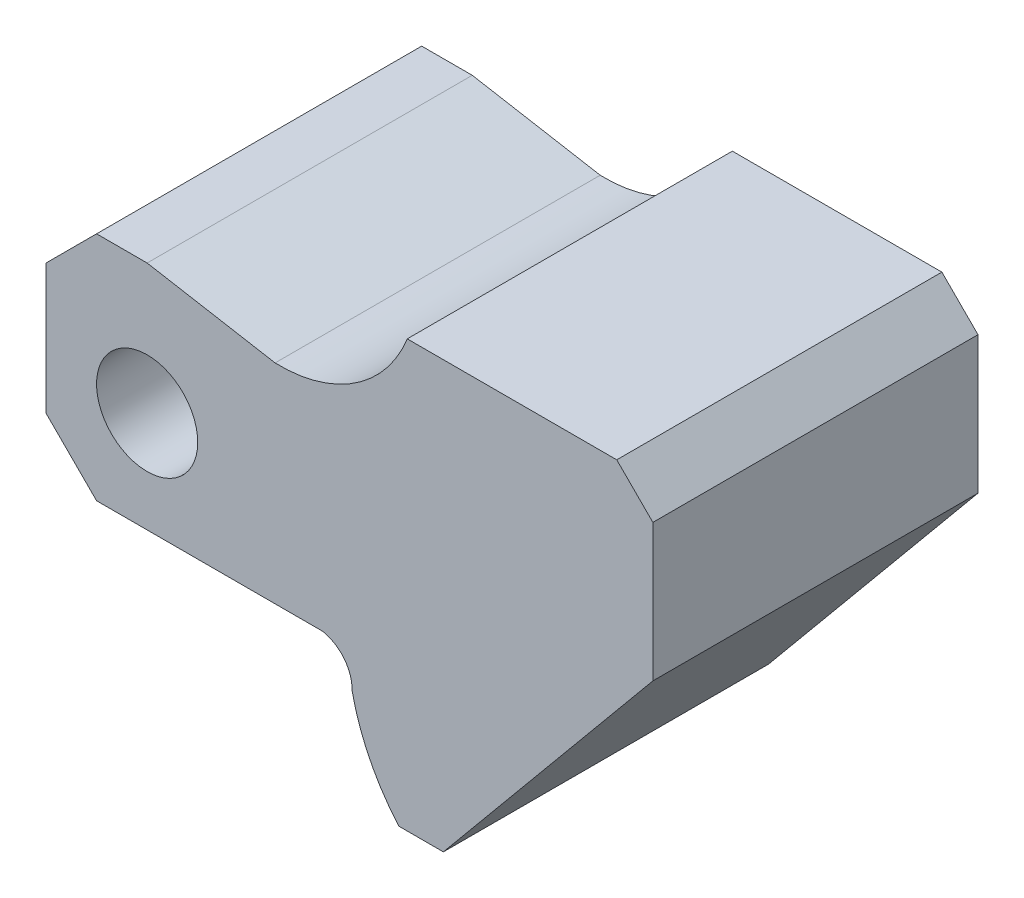
ISO-10303-21;
HEADER;
FILE_DESCRIPTION(('STEP AP214'),'2;1');
FILE_NAME('part.step','',(''),(''),'','','');
FILE_SCHEMA(('AUTOMOTIVE_DESIGN { 1 0 10303 214 1 1 1 1 }'));
ENDSEC;
DATA;
#1=APPLICATION_CONTEXT('core data for automotive mechanical design processes');
#2=APPLICATION_PROTOCOL_DEFINITION('international standard','automotive_design',2000,#1);
#3=PRODUCT_CONTEXT('',#1,'mechanical');
#4=PRODUCT('Part','Part','',(#3));
#5=PRODUCT_RELATED_PRODUCT_CATEGORY('part','',(#4));
#6=PRODUCT_DEFINITION_FORMATION('','',#4);
#7=PRODUCT_DEFINITION_CONTEXT('part definition',#1,'design');
#8=PRODUCT_DEFINITION('design','',#6,#7);
#9=PRODUCT_DEFINITION_SHAPE('','',#8);
#10=(LENGTH_UNIT() NAMED_UNIT(*) SI_UNIT(.MILLI.,.METRE.));
#11=(NAMED_UNIT(*) PLANE_ANGLE_UNIT() SI_UNIT($,.RADIAN.));
#12=(NAMED_UNIT(*) SI_UNIT($,.STERADIAN.) SOLID_ANGLE_UNIT());
#13=UNCERTAINTY_MEASURE_WITH_UNIT(LENGTH_MEASURE(1.E-05),#10,'distance_accuracy_value','');
#14=(GEOMETRIC_REPRESENTATION_CONTEXT(3) GLOBAL_UNCERTAINTY_ASSIGNED_CONTEXT((#13)) GLOBAL_UNIT_ASSIGNED_CONTEXT((#10,
#11,#12)) REPRESENTATION_CONTEXT('',''));
#15=CARTESIAN_POINT('',(0.,0.,0.));
#16=DIRECTION('',(0.,0.,1.));
#17=DIRECTION('',(1.,0.,0.));
#18=AXIS2_PLACEMENT_3D('',#15,#16,#17);
#19=CARTESIAN_POINT('',(17.0554988623098,8.67643427055628,45.));
#20=DIRECTION('',(0.707106781186536,0.707106781186559,0.));
#21=DIRECTION('',(-0.707106781186559,0.707106781186536,0.));
#22=AXIS2_PLACEMENT_3D('',#19,#20,#21);
#23=PLANE('',#22);
#24=DIRECTION('',(0.707106781186559,-0.707106781186536,0.));
#25=VECTOR('',#24,1.);
#26=CARTESIAN_POINT('',(17.0554988623098,8.67643427055628,0.));
#27=LINE('',#26,#25);
#28=CARTESIAN_POINT('',(17.0554988623098,8.67643427055628,0.));
#29=VERTEX_POINT('',#28);
#30=CARTESIAN_POINT('',(24.05549886231,1.67643427055628,0.));
#31=VERTEX_POINT('',#30);
#32=EDGE_CURVE('E169',#29,#31,#27,.T.);
#33=ORIENTED_EDGE('',*,*,#32,.T.);
#34=DIRECTION('',(0.,0.,-1.));
#35=VECTOR('',#34,1.);
#36=CARTESIAN_POINT('',(24.05549886231,1.67643427055628,45.));
#37=LINE('',#36,#35);
#38=CARTESIAN_POINT('',(24.05549886231,1.67643427055628,45.));
#39=VERTEX_POINT('',#38);
#40=EDGE_CURVE('E11',#39,#31,#37,.T.);
#41=ORIENTED_EDGE('',*,*,#40,.F.);
#42=DIRECTION('',(0.707106781186559,-0.707106781186536,0.));
#43=VECTOR('',#42,1.);
#44=CARTESIAN_POINT('',(17.0554988623098,8.67643427055628,45.));
#45=LINE('',#44,#43);
#46=CARTESIAN_POINT('',(17.0554988623098,8.67643427055628,45.));
#47=VERTEX_POINT('',#46);
#48=EDGE_CURVE('E196',#47,#39,#45,.T.);
#49=ORIENTED_EDGE('',*,*,#48,.F.);
#50=DIRECTION('',(0.,0.,-1.));
#51=VECTOR('',#50,1.);
#52=CARTESIAN_POINT('',(17.0554988623098,8.67643427055628,45.));
#53=LINE('',#52,#51);
#54=EDGE_CURVE('E165',#47,#29,#53,.T.);
#55=ORIENTED_EDGE('',*,*,#54,.T.);
#56=EDGE_LOOP('',(#33,#41,#49,#55));
#57=FACE_BOUND('',#56,.T.);
#58=ADVANCED_FACE('F37',(#57),#23,.F.);
#59=CARTESIAN_POINT('',(24.05549886231,1.67643427055628,45.));
#60=DIRECTION('',(0.,1.,0.));
#61=DIRECTION('',(0.,0.,1.));
#62=AXIS2_PLACEMENT_3D('',#59,#60,#61);
#63=PLANE('',#62);
#64=DIRECTION('',(1.,0.,0.));
#65=VECTOR('',#64,1.);
#66=CARTESIAN_POINT('',(24.05549886231,1.67643427055628,0.));
#67=LINE('',#66,#65);
#68=CARTESIAN_POINT('',(55.3501909394758,1.67643427055628,0.));
#69=VERTEX_POINT('',#68);
#70=EDGE_CURVE('E172',#31,#69,#67,.T.);
#71=ORIENTED_EDGE('',*,*,#70,.T.);
#72=DIRECTION('',(0.,0.,-1.));
#73=VECTOR('',#72,1.);
#74=CARTESIAN_POINT('',(55.3501909394758,1.67643427055628,45.));
#75=LINE('',#74,#73);
#76=CARTESIAN_POINT('',(55.3501909394758,1.67643427055628,45.));
#77=VERTEX_POINT('',#76);
#78=EDGE_CURVE('E45',#77,#69,#75,.T.);
#79=ORIENTED_EDGE('',*,*,#78,.F.);
#80=DIRECTION('',(1.,0.,0.));
#81=VECTOR('',#80,1.);
#82=CARTESIAN_POINT('',(24.05549886231,1.67643427055628,45.));
#83=LINE('',#82,#81);
#84=EDGE_CURVE('E114',#39,#77,#83,.T.);
#85=ORIENTED_EDGE('',*,*,#84,.F.);
#86=ORIENTED_EDGE('',*,*,#40,.T.);
#87=EDGE_LOOP('',(#71,#79,#85,#86));
#88=FACE_BOUND('',#87,.T.);
#89=ADVANCED_FACE('F285',(#88),#63,.F.);
#90=CARTESIAN_POINT('',(54.4210365067645,-3.2364744442656,45.));
#91=DIRECTION('',(0.,0.,-1.));
#92=DIRECTION('',(-1.,0.,0.));
#93=AXIS2_PLACEMENT_3D('',#90,#91,#92);
#94=CYLINDRICAL_SURFACE('',#93,5.);
#95=CARTESIAN_POINT('',(54.4210365067645,-3.2364744442656,0.));
#96=DIRECTION('',(0.,0.,-1.));
#97=DIRECTION('',(-1.,0.,0.));
#98=AXIS2_PLACEMENT_3D('',#95,#96,#97);
#99=CIRCLE('',#98,5.);
#100=CARTESIAN_POINT('',(59.4189330122395,-3.38149347943139,0.));
#101=VERTEX_POINT('',#100);
#102=EDGE_CURVE('E175',#69,#101,#99,.T.);
#103=ORIENTED_EDGE('',*,*,#102,.T.);
#104=DIRECTION('',(0.,0.,-1.));
#105=VECTOR('',#104,1.);
#106=CARTESIAN_POINT('',(59.4189330122395,-3.38149347943139,45.));
#107=LINE('',#106,#105);
#108=CARTESIAN_POINT('',(59.4189330122395,-3.38149347943139,45.));
#109=VERTEX_POINT('',#108);
#110=EDGE_CURVE('E221',#109,#101,#107,.T.);
#111=ORIENTED_EDGE('',*,*,#110,.F.);
#112=CARTESIAN_POINT('',(54.4210365067645,-3.2364744442656,45.));
#113=DIRECTION('',(0.,0.,-1.));
#114=DIRECTION('',(-1.,0.,0.));
#115=AXIS2_PLACEMENT_3D('',#112,#113,#114);
#116=CIRCLE('',#115,5.);
#117=EDGE_CURVE('E229',#77,#109,#116,.T.);
#118=ORIENTED_EDGE('',*,*,#117,.F.);
#119=ORIENTED_EDGE('',*,*,#78,.T.);
#120=EDGE_LOOP('',(#103,#111,#118,#119));
#121=FACE_BOUND('',#120,.T.);
#122=ADVANCED_FACE('F227',(#121),#94,.F.);
#123=CARTESIAN_POINT('',(87.7983560051669,2.58577981651378,45.));
#124=DIRECTION('',(0.,0.,-1.));
#125=DIRECTION('',(-1.,0.,0.));
#126=AXIS2_PLACEMENT_3D('',#123,#124,#125);
#127=CYLINDRICAL_SURFACE('',#126,29.);
#128=CARTESIAN_POINT('',(87.7983560051669,2.58577981651378,0.));
#129=DIRECTION('',(0.,0.,1.));
#130=DIRECTION('',(1.,0.,0.));
#131=AXIS2_PLACEMENT_3D('',#128,#129,#130);
#132=CIRCLE('',#131,29.);
#133=CARTESIAN_POINT('',(65.8894537049603,-16.4142201834862,0.));
#134=VERTEX_POINT('',#133);
#135=EDGE_CURVE('E177',#101,#134,#132,.T.);
#136=ORIENTED_EDGE('',*,*,#135,.T.);
#137=DIRECTION('',(0.,0.,-1.));
#138=VECTOR('',#137,1.);
#139=CARTESIAN_POINT('',(65.8894537049603,-16.4142201834862,45.));
#140=LINE('',#139,#138);
#141=CARTESIAN_POINT('',(65.8894537049603,-16.4142201834862,45.));
#142=VERTEX_POINT('',#141);
#143=EDGE_CURVE('E218',#142,#134,#140,.T.);
#144=ORIENTED_EDGE('',*,*,#143,.F.);
#145=CARTESIAN_POINT('',(87.7983560051669,2.58577981651378,45.));
#146=DIRECTION('',(0.,0.,1.));
#147=DIRECTION('',(1.,0.,0.));
#148=AXIS2_PLACEMENT_3D('',#145,#146,#147);
#149=CIRCLE('',#148,29.);
#150=EDGE_CURVE('E247',#109,#142,#149,.T.);
#151=ORIENTED_EDGE('',*,*,#150,.F.);
#152=ORIENTED_EDGE('',*,*,#110,.T.);
#153=EDGE_LOOP('',(#136,#144,#151,#152));
#154=FACE_BOUND('',#153,.T.);
#155=ADVANCED_FACE('F238',(#154),#127,.T.);
#156=CARTESIAN_POINT('',(65.8894537049603,-16.4142201834862,45.));
#157=DIRECTION('',(0.,1.,0.));
#158=DIRECTION('',(0.,0.,1.));
#159=AXIS2_PLACEMENT_3D('',#156,#157,#158);
#160=PLANE('',#159);
#161=DIRECTION('',(1.,0.,0.));
#162=VECTOR('',#161,1.);
#163=CARTESIAN_POINT('',(65.8894537049603,-16.4142201834862,0.));
#164=LINE('',#163,#162);
#165=CARTESIAN_POINT('',(72.0554988623098,-16.4142201834862,0.));
#166=VERTEX_POINT('',#165);
#167=EDGE_CURVE('E179',#134,#166,#164,.T.);
#168=ORIENTED_EDGE('',*,*,#167,.T.);
#169=DIRECTION('',(0.,0.,-1.));
#170=VECTOR('',#169,1.);
#171=CARTESIAN_POINT('',(72.0554988623098,-16.4142201834862,45.));
#172=LINE('',#171,#170);
#173=CARTESIAN_POINT('',(72.0554988623098,-16.4142201834862,45.));
#174=VERTEX_POINT('',#173);
#175=EDGE_CURVE('E215',#174,#166,#172,.T.);
#176=ORIENTED_EDGE('',*,*,#175,.F.);
#177=DIRECTION('',(1.,0.,0.));
#178=VECTOR('',#177,1.);
#179=CARTESIAN_POINT('',(65.8894537049603,-16.4142201834862,45.));
#180=LINE('',#179,#178);
#181=EDGE_CURVE('E244',#142,#174,#180,.T.);
#182=ORIENTED_EDGE('',*,*,#181,.F.);
#183=ORIENTED_EDGE('',*,*,#143,.T.);
#184=EDGE_LOOP('',(#168,#176,#182,#183));
#185=FACE_BOUND('',#184,.T.);
#186=ADVANCED_FACE('F242',(#185),#160,.F.);
#187=CARTESIAN_POINT('',(101.05549886231,18.5857798165138,45.));
#188=DIRECTION('',(-0.770021560905562,0.638017864750323,0.));
#189=DIRECTION('',(-0.638017864750323,-0.770021560905562,0.));
#190=AXIS2_PLACEMENT_3D('',#187,#188,#189);
#191=PLANE('',#190);
#192=DIRECTION('',(0.638017864750323,0.770021560905562,0.));
#193=VECTOR('',#192,1.);
#194=CARTESIAN_POINT('',(101.05549886231,18.5857798165138,0.));
#195=LINE('',#194,#193);
#196=CARTESIAN_POINT('',(101.05549886231,18.5857798165138,0.));
#197=VERTEX_POINT('',#196);
#198=EDGE_CURVE('E181',#166,#197,#195,.T.);
#199=ORIENTED_EDGE('',*,*,#198,.T.);
#200=DIRECTION('',(0.,0.,-1.));
#201=VECTOR('',#200,1.);
#202=CARTESIAN_POINT('',(101.05549886231,18.5857798165138,45.));
#203=LINE('',#202,#201);
#204=CARTESIAN_POINT('',(101.05549886231,18.5857798165138,45.));
#205=VERTEX_POINT('',#204);
#206=EDGE_CURVE('E212',#205,#197,#203,.T.);
#207=ORIENTED_EDGE('',*,*,#206,.F.);
#208=DIRECTION('',(0.638017864750323,0.770021560905562,0.));
#209=VECTOR('',#208,1.);
#210=CARTESIAN_POINT('',(101.05549886231,18.5857798165138,45.));
#211=LINE('',#210,#209);
#212=EDGE_CURVE('E246',#174,#205,#211,.T.);
#213=ORIENTED_EDGE('',*,*,#212,.F.);
#214=ORIENTED_EDGE('',*,*,#175,.T.);
#215=EDGE_LOOP('',(#199,#207,#213,#214));
#216=FACE_BOUND('',#215,.T.);
#217=ADVANCED_FACE('F298',(#216),#191,.F.);
#218=CARTESIAN_POINT('',(101.05549886231,37.5857798165138,45.));
#219=DIRECTION('',(-1.,0.,0.));
#220=DIRECTION('',(0.,0.,1.));
#221=AXIS2_PLACEMENT_3D('',#218,#219,#220);
#222=PLANE('',#221);
#223=DIRECTION('',(0.,1.,0.));
#224=VECTOR('',#223,1.);
#225=CARTESIAN_POINT('',(101.05549886231,37.5857798165138,0.));
#226=LINE('',#225,#224);
#227=CARTESIAN_POINT('',(101.05549886231,37.5857798165138,0.));
#228=VERTEX_POINT('',#227);
#229=EDGE_CURVE('E183',#197,#228,#226,.T.);
#230=ORIENTED_EDGE('',*,*,#229,.T.);
#231=DIRECTION('',(0.,0.,-1.));
#232=VECTOR('',#231,1.);
#233=CARTESIAN_POINT('',(101.05549886231,37.5857798165138,45.));
#234=LINE('',#233,#232);
#235=CARTESIAN_POINT('',(101.05549886231,37.5857798165138,45.));
#236=VERTEX_POINT('',#235);
#237=EDGE_CURVE('E209',#236,#228,#234,.T.);
#238=ORIENTED_EDGE('',*,*,#237,.F.);
#239=DIRECTION('',(0.,1.,0.));
#240=VECTOR('',#239,1.);
#241=CARTESIAN_POINT('',(101.05549886231,37.5857798165138,45.));
#242=LINE('',#241,#240);
#243=EDGE_CURVE('E249',#205,#236,#242,.T.);
#244=ORIENTED_EDGE('',*,*,#243,.F.);
#245=ORIENTED_EDGE('',*,*,#206,.T.);
#246=EDGE_LOOP('',(#230,#238,#244,#245));
#247=FACE_BOUND('',#246,.T.);
#248=ADVANCED_FACE('F301',(#247),#222,.F.);
#249=CARTESIAN_POINT('',(96.0554988623098,42.5857798165138,45.));
#250=DIRECTION('',(-0.707106781186546,-0.707106781186549,0.));
#251=DIRECTION('',(0.707106781186549,-0.707106781186546,0.));
#252=AXIS2_PLACEMENT_3D('',#249,#250,#251);
#253=PLANE('',#252);
#254=DIRECTION('',(-0.707106781186549,0.707106781186546,0.));
#255=VECTOR('',#254,1.);
#256=CARTESIAN_POINT('',(96.0554988623098,42.5857798165138,0.));
#257=LINE('',#256,#255);
#258=CARTESIAN_POINT('',(96.0554988623098,42.5857798165138,0.));
#259=VERTEX_POINT('',#258);
#260=EDGE_CURVE('E185',#228,#259,#257,.T.);
#261=ORIENTED_EDGE('',*,*,#260,.T.);
#262=DIRECTION('',(0.,0.,-1.));
#263=VECTOR('',#262,1.);
#264=CARTESIAN_POINT('',(96.0554988623098,42.5857798165138,45.));
#265=LINE('',#264,#263);
#266=CARTESIAN_POINT('',(96.0554988623098,42.5857798165138,45.));
#267=VERTEX_POINT('',#266);
#268=EDGE_CURVE('E206',#267,#259,#265,.T.);
#269=ORIENTED_EDGE('',*,*,#268,.F.);
#270=DIRECTION('',(-0.707106781186549,0.707106781186546,0.));
#271=VECTOR('',#270,1.);
#272=CARTESIAN_POINT('',(96.0554988623098,42.5857798165138,45.));
#273=LINE('',#272,#271);
#274=EDGE_CURVE('E255',#236,#267,#273,.T.);
#275=ORIENTED_EDGE('',*,*,#274,.F.);
#276=ORIENTED_EDGE('',*,*,#237,.T.);
#277=EDGE_LOOP('',(#261,#269,#275,#276));
#278=FACE_BOUND('',#277,.T.);
#279=ADVANCED_FACE('F305',(#278),#253,.F.);
#280=CARTESIAN_POINT('',(67.0554988623098,42.5857798165138,45.));
#281=DIRECTION('',(0.,-1.,0.));
#282=DIRECTION('',(1.,0.,0.));
#283=AXIS2_PLACEMENT_3D('',#280,#281,#282);
#284=PLANE('',#283);
#285=DIRECTION('',(-1.,0.,0.));
#286=VECTOR('',#285,1.);
#287=CARTESIAN_POINT('',(67.0554988623098,42.5857798165138,0.));
#288=LINE('',#287,#286);
#289=CARTESIAN_POINT('',(67.0554988623098,42.5857798165138,0.));
#290=VERTEX_POINT('',#289);
#291=EDGE_CURVE('E187',#259,#290,#288,.T.);
#292=ORIENTED_EDGE('',*,*,#291,.T.);
#293=DIRECTION('',(0.,0.,-1.));
#294=VECTOR('',#293,1.);
#295=CARTESIAN_POINT('',(67.0554988623098,42.5857798165138,45.));
#296=LINE('',#295,#294);
#297=CARTESIAN_POINT('',(67.0554988623098,42.5857798165138,45.));
#298=VERTEX_POINT('',#297);
#299=EDGE_CURVE('E203',#298,#290,#296,.T.);
#300=ORIENTED_EDGE('',*,*,#299,.F.);
#301=DIRECTION('',(-1.,0.,0.));
#302=VECTOR('',#301,1.);
#303=CARTESIAN_POINT('',(67.0554988623098,42.5857798165138,45.));
#304=LINE('',#303,#302);
#305=EDGE_CURVE('E257',#267,#298,#304,.T.);
#306=ORIENTED_EDGE('',*,*,#305,.F.);
#307=ORIENTED_EDGE('',*,*,#268,.T.);
#308=EDGE_LOOP('',(#292,#300,#306,#307));
#309=FACE_BOUND('',#308,.T.);
#310=ADVANCED_FACE('F309',(#309),#284,.F.);
#311=CARTESIAN_POINT('',(49.3754577068336,49.5439508937919,45.));
#312=DIRECTION('',(0.,0.,-1.));
#313=DIRECTION('',(-1.,0.,0.));
#314=AXIS2_PLACEMENT_3D('',#311,#312,#313);
#315=CYLINDRICAL_SURFACE('',#314,19.);
#316=CARTESIAN_POINT('',(49.3754577068336,49.5439508937919,0.));
#317=DIRECTION('',(0.,0.,-1.));
#318=DIRECTION('',(-1.,0.,0.));
#319=AXIS2_PLACEMENT_3D('',#316,#317,#318);
#320=CIRCLE('',#319,19.);
#321=CARTESIAN_POINT('',(48.7650774955106,30.553757740545,0.));
#322=VERTEX_POINT('',#321);
#323=EDGE_CURVE('E189',#290,#322,#320,.T.);
#324=ORIENTED_EDGE('',*,*,#323,.T.);
#325=DIRECTION('',(0.,0.,-1.));
#326=VECTOR('',#325,1.);
#327=CARTESIAN_POINT('',(48.7650774955106,30.553757740545,45.));
#328=LINE('',#327,#326);
#329=CARTESIAN_POINT('',(48.7650774955106,30.553757740545,45.));
#330=VERTEX_POINT('',#329);
#331=EDGE_CURVE('E200',#330,#322,#328,.T.);
#332=ORIENTED_EDGE('',*,*,#331,.F.);
#333=CARTESIAN_POINT('',(49.3754577068336,49.5439508937919,45.));
#334=DIRECTION('',(0.,0.,-1.));
#335=DIRECTION('',(-1.,0.,0.));
#336=AXIS2_PLACEMENT_3D('',#333,#334,#335);
#337=CIRCLE('',#336,19.);
#338=EDGE_CURVE('E259',#298,#330,#337,.T.);
#339=ORIENTED_EDGE('',*,*,#338,.F.);
#340=ORIENTED_EDGE('',*,*,#299,.T.);
#341=EDGE_LOOP('',(#324,#332,#339,#340));
#342=FACE_BOUND('',#341,.T.);
#343=ADVANCED_FACE('F265',(#342),#315,.F.);
#344=CARTESIAN_POINT('',(31.0554988623098,33.6764342705563,45.));
#345=DIRECTION('',(-0.173648177666923,-0.984807753012209,0.));
#346=DIRECTION('',(0.984807753012209,-0.173648177666923,0.));
#347=AXIS2_PLACEMENT_3D('',#344,#345,#346);
#348=PLANE('',#347);
#349=DIRECTION('',(-0.984807753012209,0.173648177666923,0.));
#350=VECTOR('',#349,1.);
#351=CARTESIAN_POINT('',(31.0554988623098,33.6764342705563,0.));
#352=LINE('',#351,#350);
#353=CARTESIAN_POINT('',(31.0554988623098,33.6764342705563,0.));
#354=VERTEX_POINT('',#353);
#355=EDGE_CURVE('E191',#322,#354,#352,.T.);
#356=ORIENTED_EDGE('',*,*,#355,.T.);
#357=DIRECTION('',(0.,0.,-1.));
#358=VECTOR('',#357,1.);
#359=CARTESIAN_POINT('',(31.0554988623098,33.6764342705563,45.));
#360=LINE('',#359,#358);
#361=CARTESIAN_POINT('',(31.0554988623098,33.6764342705563,45.));
#362=VERTEX_POINT('',#361);
#363=EDGE_CURVE('E160',#362,#354,#360,.T.);
#364=ORIENTED_EDGE('',*,*,#363,.F.);
#365=DIRECTION('',(-0.984807753012209,0.173648177666923,0.));
#366=VECTOR('',#365,1.);
#367=CARTESIAN_POINT('',(31.0554988623098,33.6764342705563,45.));
#368=LINE('',#367,#366);
#369=EDGE_CURVE('E151',#330,#362,#368,.T.);
#370=ORIENTED_EDGE('',*,*,#369,.F.);
#371=ORIENTED_EDGE('',*,*,#331,.T.);
#372=EDGE_LOOP('',(#356,#364,#370,#371));
#373=FACE_BOUND('',#372,.T.);
#374=ADVANCED_FACE('F269',(#373),#348,.F.);
#375=CARTESIAN_POINT('',(31.0554988623098,33.6764342705563,45.));
#376=DIRECTION('',(0.,-1.,0.));
#377=DIRECTION('',(0.,0.,-1.));
#378=AXIS2_PLACEMENT_3D('',#375,#376,#377);
#379=PLANE('',#378);
#380=DIRECTION('',(-1.,0.,0.));
#381=VECTOR('',#380,1.);
#382=CARTESIAN_POINT('',(31.0554988623098,33.6764342705563,0.));
#383=LINE('',#382,#381);
#384=CARTESIAN_POINT('',(24.0554988623098,33.6764342705563,0.));
#385=VERTEX_POINT('',#384);
#386=EDGE_CURVE('E159',#354,#385,#383,.T.);
#387=ORIENTED_EDGE('',*,*,#386,.T.);
#388=DIRECTION('',(0.,0.,-1.));
#389=VECTOR('',#388,1.);
#390=CARTESIAN_POINT('',(24.0554988623098,33.6764342705563,45.));
#391=LINE('',#390,#389);
#392=CARTESIAN_POINT('',(24.0554988623098,33.6764342705563,45.));
#393=VERTEX_POINT('',#392);
#394=EDGE_CURVE('E156',#393,#385,#391,.T.);
#395=ORIENTED_EDGE('',*,*,#394,.F.);
#396=DIRECTION('',(-1.,0.,0.));
#397=VECTOR('',#396,1.);
#398=CARTESIAN_POINT('',(31.0554988623098,33.6764342705563,45.));
#399=LINE('',#398,#397);
#400=EDGE_CURVE('E145',#362,#393,#399,.T.);
#401=ORIENTED_EDGE('',*,*,#400,.F.);
#402=ORIENTED_EDGE('',*,*,#363,.T.);
#403=EDGE_LOOP('',(#387,#395,#401,#402));
#404=FACE_BOUND('',#403,.T.);
#405=ADVANCED_FACE('F157',(#404),#379,.F.);
#406=CARTESIAN_POINT('',(24.0554988623098,33.6764342705563,45.));
#407=DIRECTION('',(0.707106781186546,-0.707106781186549,0.));
#408=DIRECTION('',(0.707106781186549,0.707106781186546,0.));
#409=AXIS2_PLACEMENT_3D('',#406,#407,#408);
#410=PLANE('',#409);
#411=DIRECTION('',(-0.707106781186549,-0.707106781186546,0.));
#412=VECTOR('',#411,1.);
#413=CARTESIAN_POINT('',(24.0554988623098,33.6764342705563,0.));
#414=LINE('',#413,#412);
#415=CARTESIAN_POINT('',(17.0554988623098,26.6764342705563,0.));
#416=VERTEX_POINT('',#415);
#417=EDGE_CURVE('E100',#385,#416,#414,.T.);
#418=ORIENTED_EDGE('',*,*,#417,.T.);
#419=DIRECTION('',(0.,0.,-1.));
#420=VECTOR('',#419,1.);
#421=CARTESIAN_POINT('',(17.0554988623098,26.6764342705563,45.));
#422=LINE('',#421,#420);
#423=CARTESIAN_POINT('',(17.0554988623098,26.6764342705563,45.));
#424=VERTEX_POINT('',#423);
#425=EDGE_CURVE('E161',#424,#416,#422,.T.);
#426=ORIENTED_EDGE('',*,*,#425,.F.);
#427=DIRECTION('',(-0.707106781186549,-0.707106781186546,0.));
#428=VECTOR('',#427,1.);
#429=CARTESIAN_POINT('',(24.0554988623098,33.6764342705563,45.));
#430=LINE('',#429,#428);
#431=EDGE_CURVE('E149',#393,#424,#430,.T.);
#432=ORIENTED_EDGE('',*,*,#431,.F.);
#433=ORIENTED_EDGE('',*,*,#394,.T.);
#434=EDGE_LOOP('',(#418,#426,#432,#433));
#435=FACE_BOUND('',#434,.T.);
#436=ADVANCED_FACE('F163',(#435),#410,.F.);
#437=CARTESIAN_POINT('',(17.0554988623098,26.6764342705563,45.));
#438=DIRECTION('',(1.,0.,0.));
#439=DIRECTION('',(0.,1.,0.));
#440=AXIS2_PLACEMENT_3D('',#437,#438,#439);
#441=PLANE('',#440);
#442=DIRECTION('',(0.,-1.,0.));
#443=VECTOR('',#442,1.);
#444=CARTESIAN_POINT('',(17.0554988623098,26.6764342705563,0.));
#445=LINE('',#444,#443);
#446=EDGE_CURVE('E106',#416,#29,#445,.T.);
#447=ORIENTED_EDGE('',*,*,#446,.T.);
#448=ORIENTED_EDGE('',*,*,#54,.F.);
#449=DIRECTION('',(0.,-1.,0.));
#450=VECTOR('',#449,1.);
#451=CARTESIAN_POINT('',(17.0554988623098,26.6764342705563,45.));
#452=LINE('',#451,#450);
#453=EDGE_CURVE('E53',#424,#47,#452,.T.);
#454=ORIENTED_EDGE('',*,*,#453,.F.);
#455=ORIENTED_EDGE('',*,*,#425,.T.);
#456=EDGE_LOOP('',(#447,#448,#454,#455));
#457=FACE_BOUND('',#456,.T.);
#458=ADVANCED_FACE('F273',(#457),#441,.F.);
#459=CARTESIAN_POINT('',(54.4210365067645,-3.2364744442656,45.));
#460=DIRECTION('',(0.,0.,-1.));
#461=DIRECTION('',(-1.,0.,0.));
#462=AXIS2_PLACEMENT_3D('',#459,#460,#461);
#463=PLANE('',#462);
#464=CARTESIAN_POINT('',(31.0554988623098,15.6764342705563,45.));
#465=DIRECTION('',(0.,0.,1.));
#466=DIRECTION('',(1.,0.,0.));
#467=AXIS2_PLACEMENT_3D('',#464,#465,#466);
#468=CIRCLE('',#467,7.);
#469=CARTESIAN_POINT('',(38.0554988623098,15.6764342705563,45.));
#470=VERTEX_POINT('',#469);
#471=EDGE_CURVE('E364',#470,#470,#468,.T.);
#472=ORIENTED_EDGE('',*,*,#471,.F.);
#473=EDGE_LOOP('',(#472));
#474=FACE_BOUND('',#473,.T.);
#475=ORIENTED_EDGE('',*,*,#48,.T.);
#476=ORIENTED_EDGE('',*,*,#84,.T.);
#477=ORIENTED_EDGE('',*,*,#117,.T.);
#478=ORIENTED_EDGE('',*,*,#150,.T.);
#479=ORIENTED_EDGE('',*,*,#181,.T.);
#480=ORIENTED_EDGE('',*,*,#212,.T.);
#481=ORIENTED_EDGE('',*,*,#243,.T.);
#482=ORIENTED_EDGE('',*,*,#274,.T.);
#483=ORIENTED_EDGE('',*,*,#305,.T.);
#484=ORIENTED_EDGE('',*,*,#338,.T.);
#485=ORIENTED_EDGE('',*,*,#369,.T.);
#486=ORIENTED_EDGE('',*,*,#400,.T.);
#487=ORIENTED_EDGE('',*,*,#431,.T.);
#488=ORIENTED_EDGE('',*,*,#453,.T.);
#489=EDGE_LOOP('',(#475,#476,#477,#478,#479,#480,#481,#482,#483,#484,#485,#486,#487,#488));
#490=FACE_BOUND('',#489,.T.);
#491=ADVANCED_FACE('F147',(#474,#490),#463,.F.);
#492=CARTESIAN_POINT('',(54.4210365067645,-3.2364744442656,0.));
#493=DIRECTION('',(0.,0.,-1.));
#494=DIRECTION('',(-1.,0.,0.));
#495=AXIS2_PLACEMENT_3D('',#492,#493,#494);
#496=PLANE('',#495);
#497=CARTESIAN_POINT('',(31.0554988623098,15.6764342705563,0.));
#498=DIRECTION('',(0.,0.,1.));
#499=DIRECTION('',(1.,0.,0.));
#500=AXIS2_PLACEMENT_3D('',#497,#498,#499);
#501=CIRCLE('',#500,7.);
#502=CARTESIAN_POINT('',(38.0554988623098,15.6764342705563,0.));
#503=VERTEX_POINT('',#502);
#504=EDGE_CURVE('E173',#503,#503,#501,.T.);
#505=ORIENTED_EDGE('',*,*,#504,.T.);
#506=EDGE_LOOP('',(#505));
#507=FACE_BOUND('',#506,.T.);
#508=ORIENTED_EDGE('',*,*,#32,.F.);
#509=ORIENTED_EDGE('',*,*,#446,.F.);
#510=ORIENTED_EDGE('',*,*,#417,.F.);
#511=ORIENTED_EDGE('',*,*,#386,.F.);
#512=ORIENTED_EDGE('',*,*,#355,.F.);
#513=ORIENTED_EDGE('',*,*,#323,.F.);
#514=ORIENTED_EDGE('',*,*,#291,.F.);
#515=ORIENTED_EDGE('',*,*,#260,.F.);
#516=ORIENTED_EDGE('',*,*,#229,.F.);
#517=ORIENTED_EDGE('',*,*,#198,.F.);
#518=ORIENTED_EDGE('',*,*,#167,.F.);
#519=ORIENTED_EDGE('',*,*,#135,.F.);
#520=ORIENTED_EDGE('',*,*,#102,.F.);
#521=ORIENTED_EDGE('',*,*,#70,.F.);
#522=EDGE_LOOP('',(#508,#509,#510,#511,#512,#513,#514,#515,#516,#517,#518,#519,#520,#521));
#523=FACE_BOUND('',#522,.T.);
#524=ADVANCED_FACE('F233',(#507,#523),#496,.T.);
#525=CARTESIAN_POINT('',(31.0554988623098,15.6764342705563,0.));
#526=DIRECTION('',(0.,0.,1.));
#527=DIRECTION('',(1.,0.,0.));
#528=AXIS2_PLACEMENT_3D('',#525,#526,#527);
#529=CYLINDRICAL_SURFACE('',#528,7.);
#530=ORIENTED_EDGE('',*,*,#504,.F.);
#531=EDGE_LOOP('',(#530));
#532=FACE_BOUND('',#531,.T.);
#533=ORIENTED_EDGE('',*,*,#471,.T.);
#534=EDGE_LOOP('',(#533));
#535=FACE_BOUND('',#534,.T.);
#536=ADVANCED_FACE('F346',(#532,#535),#529,.F.);
#537=CLOSED_SHELL('',(#58,#89,#122,#155,#186,#217,#248,#279,#310,#343,#374,#405,#436,#458,#491,
#524,#536));
#538=MANIFOLD_SOLID_BREP('B2',#537);
#539=ADVANCED_BREP_SHAPE_REPRESENTATION('',(#18,#538),#14);
#540=SHAPE_DEFINITION_REPRESENTATION(#9,#539);
ENDSEC;
END-ISO-10303-21;
